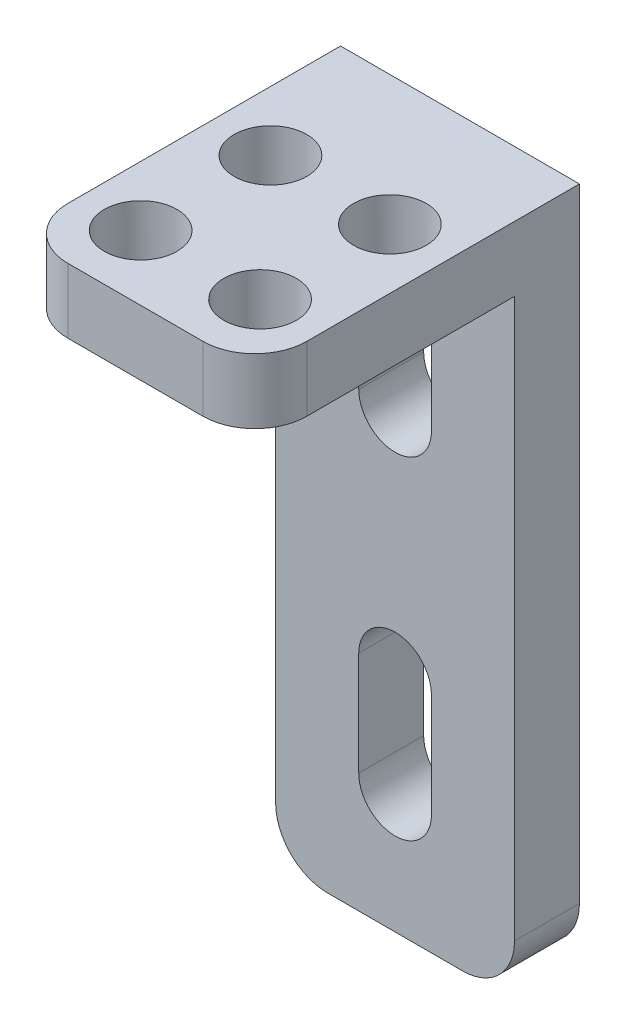
ISO-10303-21;
HEADER;
FILE_DESCRIPTION(('STEP AP214'),'2;1');
FILE_NAME('part.step','',(''),(''),'','','');
FILE_SCHEMA(('AUTOMOTIVE_DESIGN { 1 0 10303 214 1 1 1 1 }'));
ENDSEC;
DATA;
#1=APPLICATION_CONTEXT('core data for automotive mechanical design processes');
#2=APPLICATION_PROTOCOL_DEFINITION('international standard','automotive_design',2000,#1);
#3=PRODUCT_CONTEXT('',#1,'mechanical');
#4=PRODUCT('Part','Part','',(#3));
#5=PRODUCT_RELATED_PRODUCT_CATEGORY('part','',(#4));
#6=PRODUCT_DEFINITION_FORMATION('','',#4);
#7=PRODUCT_DEFINITION_CONTEXT('part definition',#1,'design');
#8=PRODUCT_DEFINITION('design','',#6,#7);
#9=PRODUCT_DEFINITION_SHAPE('','',#8);
#10=(LENGTH_UNIT() NAMED_UNIT(*) SI_UNIT(.MILLI.,.METRE.));
#11=(NAMED_UNIT(*) PLANE_ANGLE_UNIT() SI_UNIT($,.RADIAN.));
#12=(NAMED_UNIT(*) SI_UNIT($,.STERADIAN.) SOLID_ANGLE_UNIT());
#13=UNCERTAINTY_MEASURE_WITH_UNIT(LENGTH_MEASURE(1.E-05),#10,'distance_accuracy_value','');
#14=(GEOMETRIC_REPRESENTATION_CONTEXT(3) GLOBAL_UNCERTAINTY_ASSIGNED_CONTEXT((#13)) GLOBAL_UNIT_ASSIGNED_CONTEXT((#10,
#11,#12)) REPRESENTATION_CONTEXT('',''));
#15=CARTESIAN_POINT('',(0.,0.,0.));
#16=DIRECTION('',(0.,0.,1.));
#17=DIRECTION('',(1.,0.,0.));
#18=AXIS2_PLACEMENT_3D('',#15,#16,#17);
#19=CARTESIAN_POINT('',(0.,0.,3.175));
#20=DIRECTION('',(0.,0.,1.));
#21=DIRECTION('',(1.,0.,0.));
#22=AXIS2_PLACEMENT_3D('',#19,#20,#21);
#23=PLANE('',#22);
#24=DIRECTION('',(0.,-1.,0.));
#25=VECTOR('',#24,1.);
#26=CARTESIAN_POINT('',(-5.82032677750949,-16.51,3.175));
#27=LINE('',#26,#25);
#28=CARTESIAN_POINT('',(-5.82032677750949,13.335,3.175));
#29=VERTEX_POINT('',#28);
#30=CARTESIAN_POINT('',(-5.82032677750949,-13.97,3.175));
#31=VERTEX_POINT('',#30);
#32=EDGE_CURVE('E265',#29,#31,#27,.T.);
#33=ORIENTED_EDGE('',*,*,#32,.T.);
#34=CARTESIAN_POINT('',(-3.28032677750948,-13.97,3.175));
#35=DIRECTION('',(0.,0.,1.));
#36=DIRECTION('',(1.,0.,0.));
#37=AXIS2_PLACEMENT_3D('',#34,#35,#36);
#38=CIRCLE('',#37,2.54);
#39=CARTESIAN_POINT('',(-3.28032677750948,-16.51,3.175));
#40=VERTEX_POINT('',#39);
#41=EDGE_CURVE('E296',#31,#40,#38,.T.);
#42=ORIENTED_EDGE('',*,*,#41,.T.);
#43=DIRECTION('',(1.,0.,0.));
#44=VECTOR('',#43,1.);
#45=CARTESIAN_POINT('',(5.86367322249051,-16.51,3.175));
#46=LINE('',#45,#44);
#47=CARTESIAN_POINT('',(3.32367322249051,-16.51,3.175));
#48=VERTEX_POINT('',#47);
#49=EDGE_CURVE('E187',#40,#48,#46,.T.);
#50=ORIENTED_EDGE('',*,*,#49,.T.);
#51=CARTESIAN_POINT('',(3.32367322249051,-13.97,3.175));
#52=DIRECTION('',(0.,0.,1.));
#53=DIRECTION('',(1.,0.,0.));
#54=AXIS2_PLACEMENT_3D('',#51,#52,#53);
#55=CIRCLE('',#54,2.54);
#56=CARTESIAN_POINT('',(5.86367322249051,-13.97,3.175));
#57=VERTEX_POINT('',#56);
#58=EDGE_CURVE('E185',#48,#57,#55,.T.);
#59=ORIENTED_EDGE('',*,*,#58,.T.);
#60=DIRECTION('',(0.,1.,0.));
#61=VECTOR('',#60,1.);
#62=CARTESIAN_POINT('',(5.86367322249051,-16.51,3.175));
#63=LINE('',#62,#61);
#64=CARTESIAN_POINT('',(5.86367322249051,13.335,3.175));
#65=VERTEX_POINT('',#64);
#66=EDGE_CURVE('E167',#57,#65,#63,.T.);
#67=ORIENTED_EDGE('',*,*,#66,.T.);
#68=DIRECTION('',(1.,0.,0.));
#69=VECTOR('',#68,1.);
#70=CARTESIAN_POINT('',(-5.82032677750949,13.335,3.175));
#71=LINE('',#70,#69);
#72=EDGE_CURVE('E181',#29,#65,#71,.T.);
#73=ORIENTED_EDGE('',*,*,#72,.F.);
#74=EDGE_LOOP('',(#33,#42,#50,#59,#67,#73));
#75=FACE_BOUND('',#74,.T.);
#76=DIRECTION('',(0.,1.,0.));
#77=VECTOR('',#76,1.);
#78=CARTESIAN_POINT('',(1.79967322249051,5.588,3.175));
#79=LINE('',#78,#77);
#80=CARTESIAN_POINT('',(1.79967322249051,5.588,3.175));
#81=VERTEX_POINT('',#80);
#82=CARTESIAN_POINT('',(1.79967322249051,10.668,3.175));
#83=VERTEX_POINT('',#82);
#84=EDGE_CURVE('E236',#81,#83,#79,.T.);
#85=ORIENTED_EDGE('',*,*,#84,.F.);
#86=CARTESIAN_POINT('',(0.0216732224905147,5.588,3.175));
#87=DIRECTION('',(0.,0.,1.));
#88=DIRECTION('',(1.,0.,0.));
#89=AXIS2_PLACEMENT_3D('',#86,#87,#88);
#90=CIRCLE('',#89,1.778);
#91=CARTESIAN_POINT('',(-1.75632677750949,5.588,3.175));
#92=VERTEX_POINT('',#91);
#93=EDGE_CURVE('E234',#92,#81,#90,.T.);
#94=ORIENTED_EDGE('',*,*,#93,.F.);
#95=DIRECTION('',(0.,-1.,0.));
#96=VECTOR('',#95,1.);
#97=CARTESIAN_POINT('',(-1.75632677750949,5.588,3.175));
#98=LINE('',#97,#96);
#99=CARTESIAN_POINT('',(-1.75632677750949,10.668,3.175));
#100=VERTEX_POINT('',#99);
#101=EDGE_CURVE('E242',#100,#92,#98,.T.);
#102=ORIENTED_EDGE('',*,*,#101,.F.);
#103=CARTESIAN_POINT('',(0.0216732224905147,10.668,3.175));
#104=DIRECTION('',(0.,0.,1.));
#105=DIRECTION('',(1.,0.,0.));
#106=AXIS2_PLACEMENT_3D('',#103,#104,#105);
#107=CIRCLE('',#106,1.778);
#108=EDGE_CURVE('E239',#83,#100,#107,.T.);
#109=ORIENTED_EDGE('',*,*,#108,.F.);
#110=EDGE_LOOP('',(#85,#94,#102,#109));
#111=FACE_BOUND('',#110,.T.);
#112=DIRECTION('',(0.,-1.,0.));
#113=VECTOR('',#112,1.);
#114=CARTESIAN_POINT('',(-1.75632677750949,-5.588,3.175));
#115=LINE('',#114,#113);
#116=CARTESIAN_POINT('',(-1.75632677750949,-5.588,3.175));
#117=VERTEX_POINT('',#116);
#118=CARTESIAN_POINT('',(-1.75632677750949,-10.668,3.175));
#119=VERTEX_POINT('',#118);
#120=EDGE_CURVE('E205',#117,#119,#115,.T.);
#121=ORIENTED_EDGE('',*,*,#120,.F.);
#122=CARTESIAN_POINT('',(0.0216732224905147,-5.588,3.175));
#123=DIRECTION('',(0.,0.,1.));
#124=DIRECTION('',(-1.,0.,0.));
#125=AXIS2_PLACEMENT_3D('',#122,#123,#124);
#126=CIRCLE('',#125,1.778);
#127=CARTESIAN_POINT('',(1.79967322249051,-5.588,3.175));
#128=VERTEX_POINT('',#127);
#129=EDGE_CURVE('E203',#128,#117,#126,.T.);
#130=ORIENTED_EDGE('',*,*,#129,.F.);
#131=DIRECTION('',(0.,1.,0.));
#132=VECTOR('',#131,1.);
#133=CARTESIAN_POINT('',(1.79967322249051,-5.588,3.175));
#134=LINE('',#133,#132);
#135=CARTESIAN_POINT('',(1.79967322249051,-10.668,3.175));
#136=VERTEX_POINT('',#135);
#137=EDGE_CURVE('E211',#136,#128,#134,.T.);
#138=ORIENTED_EDGE('',*,*,#137,.F.);
#139=CARTESIAN_POINT('',(0.0216732224905147,-10.668,3.175));
#140=DIRECTION('',(0.,0.,1.));
#141=DIRECTION('',(-1.,0.,0.));
#142=AXIS2_PLACEMENT_3D('',#139,#140,#141);
#143=CIRCLE('',#142,1.778);
#144=EDGE_CURVE('E208',#119,#136,#143,.T.);
#145=ORIENTED_EDGE('',*,*,#144,.F.);
#146=EDGE_LOOP('',(#121,#130,#138,#145));
#147=FACE_BOUND('',#146,.T.);
#148=ADVANCED_FACE('F36',(#75,#111,#147),#23,.T.);
#149=CARTESIAN_POINT('',(0.,0.,0.));
#150=DIRECTION('',(0.,0.,1.));
#151=DIRECTION('',(1.,0.,0.));
#152=AXIS2_PLACEMENT_3D('',#149,#150,#151);
#153=PLANE('',#152);
#154=CARTESIAN_POINT('',(0.0216732224905147,5.588,0.));
#155=DIRECTION('',(0.,0.,1.));
#156=DIRECTION('',(1.,0.,0.));
#157=AXIS2_PLACEMENT_3D('',#154,#155,#156);
#158=CIRCLE('',#157,1.778);
#159=CARTESIAN_POINT('',(-1.75632677750949,5.588,0.));
#160=VERTEX_POINT('',#159);
#161=CARTESIAN_POINT('',(1.79967322249051,5.588,0.));
#162=VERTEX_POINT('',#161);
#163=EDGE_CURVE('E233',#160,#162,#158,.T.);
#164=ORIENTED_EDGE('',*,*,#163,.T.);
#165=DIRECTION('',(0.,1.,0.));
#166=VECTOR('',#165,1.);
#167=CARTESIAN_POINT('',(1.79967322249051,5.588,0.));
#168=LINE('',#167,#166);
#169=CARTESIAN_POINT('',(1.79967322249051,10.668,0.));
#170=VERTEX_POINT('',#169);
#171=EDGE_CURVE('E247',#162,#170,#168,.T.);
#172=ORIENTED_EDGE('',*,*,#171,.T.);
#173=CARTESIAN_POINT('',(0.0216732224905147,10.668,0.));
#174=DIRECTION('',(0.,0.,1.));
#175=DIRECTION('',(1.,0.,0.));
#176=AXIS2_PLACEMENT_3D('',#173,#174,#175);
#177=CIRCLE('',#176,1.778);
#178=CARTESIAN_POINT('',(-1.75632677750949,10.668,0.));
#179=VERTEX_POINT('',#178);
#180=EDGE_CURVE('E250',#170,#179,#177,.T.);
#181=ORIENTED_EDGE('',*,*,#180,.T.);
#182=DIRECTION('',(0.,-1.,0.));
#183=VECTOR('',#182,1.);
#184=CARTESIAN_POINT('',(-1.75632677750949,5.588,0.));
#185=LINE('',#184,#183);
#186=EDGE_CURVE('E237',#179,#160,#185,.T.);
#187=ORIENTED_EDGE('',*,*,#186,.T.);
#188=EDGE_LOOP('',(#164,#172,#181,#187));
#189=FACE_BOUND('',#188,.T.);
#190=DIRECTION('',(1.,0.,0.));
#191=VECTOR('',#190,1.);
#192=CARTESIAN_POINT('',(5.86367322249051,-16.51,0.));
#193=LINE('',#192,#191);
#194=CARTESIAN_POINT('',(-3.28032677750948,-16.51,0.));
#195=VERTEX_POINT('',#194);
#196=CARTESIAN_POINT('',(3.32367322249051,-16.51,0.));
#197=VERTEX_POINT('',#196);
#198=EDGE_CURVE('E271',#195,#197,#193,.T.);
#199=ORIENTED_EDGE('',*,*,#198,.F.);
#200=CARTESIAN_POINT('',(-3.28032677750948,-13.97,0.));
#201=DIRECTION('',(0.,0.,1.));
#202=DIRECTION('',(1.,0.,0.));
#203=AXIS2_PLACEMENT_3D('',#200,#201,#202);
#204=CIRCLE('',#203,2.54);
#205=CARTESIAN_POINT('',(-5.82032677750949,-13.97,0.));
#206=VERTEX_POINT('',#205);
#207=EDGE_CURVE('E289',#195,#206,#204,.F.);
#208=ORIENTED_EDGE('',*,*,#207,.T.);
#209=DIRECTION('',(0.,-1.,0.));
#210=VECTOR('',#209,1.);
#211=CARTESIAN_POINT('',(-5.82032677750949,-16.51,0.));
#212=LINE('',#211,#210);
#213=CARTESIAN_POINT('',(-5.82032677750949,16.51,0.));
#214=VERTEX_POINT('',#213);
#215=EDGE_CURVE('E264',#214,#206,#212,.T.);
#216=ORIENTED_EDGE('',*,*,#215,.F.);
#217=DIRECTION('',(-1.,0.,0.));
#218=VECTOR('',#217,1.);
#219=CARTESIAN_POINT('',(5.86367322249051,16.51,0.));
#220=LINE('',#219,#218);
#221=CARTESIAN_POINT('',(5.86367322249051,16.51,0.));
#222=VERTEX_POINT('',#221);
#223=EDGE_CURVE('E267',#222,#214,#220,.T.);
#224=ORIENTED_EDGE('',*,*,#223,.F.);
#225=DIRECTION('',(0.,1.,0.));
#226=VECTOR('',#225,1.);
#227=CARTESIAN_POINT('',(5.86367322249051,-16.51,0.));
#228=LINE('',#227,#226);
#229=CARTESIAN_POINT('',(5.86367322249051,-13.97,0.));
#230=VERTEX_POINT('',#229);
#231=EDGE_CURVE('E274',#230,#222,#228,.T.);
#232=ORIENTED_EDGE('',*,*,#231,.F.);
#233=CARTESIAN_POINT('',(3.32367322249051,-13.97,0.));
#234=DIRECTION('',(0.,0.,1.));
#235=DIRECTION('',(1.,0.,0.));
#236=AXIS2_PLACEMENT_3D('',#233,#234,#235);
#237=CIRCLE('',#236,2.54);
#238=EDGE_CURVE('E287',#230,#197,#237,.F.);
#239=ORIENTED_EDGE('',*,*,#238,.T.);
#240=EDGE_LOOP('',(#199,#208,#216,#224,#232,#239));
#241=FACE_BOUND('',#240,.T.);
#242=CARTESIAN_POINT('',(0.0216732224905147,-5.588,0.));
#243=DIRECTION('',(0.,0.,1.));
#244=DIRECTION('',(-1.,0.,0.));
#245=AXIS2_PLACEMENT_3D('',#242,#243,#244);
#246=CIRCLE('',#245,1.778);
#247=CARTESIAN_POINT('',(1.79967322249051,-5.588,0.));
#248=VERTEX_POINT('',#247);
#249=CARTESIAN_POINT('',(-1.75632677750949,-5.588,0.));
#250=VERTEX_POINT('',#249);
#251=EDGE_CURVE('E202',#248,#250,#246,.T.);
#252=ORIENTED_EDGE('',*,*,#251,.T.);
#253=DIRECTION('',(0.,-1.,0.));
#254=VECTOR('',#253,1.);
#255=CARTESIAN_POINT('',(-1.75632677750949,-5.588,0.));
#256=LINE('',#255,#254);
#257=CARTESIAN_POINT('',(-1.75632677750949,-10.668,0.));
#258=VERTEX_POINT('',#257);
#259=EDGE_CURVE('E216',#250,#258,#256,.T.);
#260=ORIENTED_EDGE('',*,*,#259,.T.);
#261=CARTESIAN_POINT('',(0.0216732224905147,-10.668,0.));
#262=DIRECTION('',(0.,0.,1.));
#263=DIRECTION('',(-1.,0.,0.));
#264=AXIS2_PLACEMENT_3D('',#261,#262,#263);
#265=CIRCLE('',#264,1.778);
#266=CARTESIAN_POINT('',(1.79967322249051,-10.668,0.));
#267=VERTEX_POINT('',#266);
#268=EDGE_CURVE('E219',#258,#267,#265,.T.);
#269=ORIENTED_EDGE('',*,*,#268,.T.);
#270=DIRECTION('',(0.,1.,0.));
#271=VECTOR('',#270,1.);
#272=CARTESIAN_POINT('',(1.79967322249051,-5.588,0.));
#273=LINE('',#272,#271);
#274=EDGE_CURVE('E206',#267,#248,#273,.T.);
#275=ORIENTED_EDGE('',*,*,#274,.T.);
#276=EDGE_LOOP('',(#252,#260,#269,#275));
#277=FACE_BOUND('',#276,.T.);
#278=ADVANCED_FACE('F329',(#189,#241,#277),#153,.F.);
#279=CARTESIAN_POINT('',(-5.82032677750949,-16.51,3.175));
#280=DIRECTION('',(1.,0.,0.));
#281=DIRECTION('',(0.,0.,-1.));
#282=AXIS2_PLACEMENT_3D('',#279,#280,#281);
#283=PLANE('',#282);
#284=ORIENTED_EDGE('',*,*,#215,.T.);
#285=DIRECTION('',(0.,0.,-1.));
#286=VECTOR('',#285,1.);
#287=CARTESIAN_POINT('',(-5.82032677750949,-13.97,3.175));
#288=LINE('',#287,#286);
#289=EDGE_CURVE('E293',#206,#31,#288,.F.);
#290=ORIENTED_EDGE('',*,*,#289,.T.);
#291=ORIENTED_EDGE('',*,*,#32,.F.);
#292=DIRECTION('',(0.,0.,-1.));
#293=VECTOR('',#292,1.);
#294=CARTESIAN_POINT('',(-5.82032677750949,13.335,15.875));
#295=LINE('',#294,#293);
#296=CARTESIAN_POINT('',(-5.82032677750949,13.335,13.335));
#297=VERTEX_POINT('',#296);
#298=EDGE_CURVE('E174',#297,#29,#295,.T.);
#299=ORIENTED_EDGE('',*,*,#298,.F.);
#300=DIRECTION('',(0.,-1.,0.));
#301=VECTOR('',#300,1.);
#302=CARTESIAN_POINT('',(-5.82032677750949,16.51,13.335));
#303=LINE('',#302,#301);
#304=CARTESIAN_POINT('',(-5.82032677750949,16.51,13.335));
#305=VERTEX_POINT('',#304);
#306=EDGE_CURVE('E291',#297,#305,#303,.F.);
#307=ORIENTED_EDGE('',*,*,#306,.T.);
#308=DIRECTION('',(0.,0.,-1.));
#309=VECTOR('',#308,1.);
#310=CARTESIAN_POINT('',(-5.82032677750949,16.51,3.175));
#311=LINE('',#310,#309);
#312=EDGE_CURVE('E186',#305,#214,#311,.T.);
#313=ORIENTED_EDGE('',*,*,#312,.T.);
#314=EDGE_LOOP('',(#284,#290,#291,#299,#307,#313));
#315=FACE_BOUND('',#314,.T.);
#316=ADVANCED_FACE('F312',(#315),#283,.F.);
#317=CARTESIAN_POINT('',(5.86367322249051,-16.51,3.175));
#318=DIRECTION('',(0.,1.,0.));
#319=DIRECTION('',(0.,0.,1.));
#320=AXIS2_PLACEMENT_3D('',#317,#318,#319);
#321=PLANE('',#320);
#322=ORIENTED_EDGE('',*,*,#49,.F.);
#323=DIRECTION('',(0.,0.,-1.));
#324=VECTOR('',#323,1.);
#325=CARTESIAN_POINT('',(-3.28032677750948,-16.51,3.175));
#326=LINE('',#325,#324);
#327=EDGE_CURVE('E284',#40,#195,#326,.T.);
#328=ORIENTED_EDGE('',*,*,#327,.T.);
#329=ORIENTED_EDGE('',*,*,#198,.T.);
#330=DIRECTION('',(0.,0.,-1.));
#331=VECTOR('',#330,1.);
#332=CARTESIAN_POINT('',(3.32367322249051,-16.51,3.175));
#333=LINE('',#332,#331);
#334=EDGE_CURVE('E282',#197,#48,#333,.F.);
#335=ORIENTED_EDGE('',*,*,#334,.T.);
#336=EDGE_LOOP('',(#322,#328,#329,#335));
#337=FACE_BOUND('',#336,.T.);
#338=ADVANCED_FACE('F345',(#337),#321,.F.);
#339=CARTESIAN_POINT('',(5.86367322249051,-16.51,3.175));
#340=DIRECTION('',(-1.,0.,0.));
#341=DIRECTION('',(0.,0.,1.));
#342=AXIS2_PLACEMENT_3D('',#339,#340,#341);
#343=PLANE('',#342);
#344=ORIENTED_EDGE('',*,*,#66,.F.);
#345=DIRECTION('',(0.,0.,-1.));
#346=VECTOR('',#345,1.);
#347=CARTESIAN_POINT('',(5.86367322249051,-13.97,3.175));
#348=LINE('',#347,#346);
#349=EDGE_CURVE('E299',#57,#230,#348,.T.);
#350=ORIENTED_EDGE('',*,*,#349,.T.);
#351=ORIENTED_EDGE('',*,*,#231,.T.);
#352=DIRECTION('',(0.,0.,-1.));
#353=VECTOR('',#352,1.);
#354=CARTESIAN_POINT('',(5.86367322249051,16.51,3.175));
#355=LINE('',#354,#353);
#356=CARTESIAN_POINT('',(5.86367322249051,16.51,13.335));
#357=VERTEX_POINT('',#356);
#358=EDGE_CURVE('E280',#357,#222,#355,.T.);
#359=ORIENTED_EDGE('',*,*,#358,.F.);
#360=DIRECTION('',(0.,1.,0.));
#361=VECTOR('',#360,1.);
#362=CARTESIAN_POINT('',(5.86367322249051,13.335,13.335));
#363=LINE('',#362,#361);
#364=CARTESIAN_POINT('',(5.86367322249051,13.335,13.335));
#365=VERTEX_POINT('',#364);
#366=EDGE_CURVE('E170',#357,#365,#363,.F.);
#367=ORIENTED_EDGE('',*,*,#366,.T.);
#368=DIRECTION('',(0.,0.,-1.));
#369=VECTOR('',#368,1.);
#370=CARTESIAN_POINT('',(5.86367322249051,13.335,15.875));
#371=LINE('',#370,#369);
#372=EDGE_CURVE('E163',#365,#65,#371,.T.);
#373=ORIENTED_EDGE('',*,*,#372,.T.);
#374=EDGE_LOOP('',(#344,#350,#351,#359,#367,#373));
#375=FACE_BOUND('',#374,.T.);
#376=ADVANCED_FACE('F165',(#375),#343,.F.);
#377=CARTESIAN_POINT('',(5.86367322249051,16.51,3.175));
#378=DIRECTION('',(0.,-1.,0.));
#379=DIRECTION('',(0.,0.,-1.));
#380=AXIS2_PLACEMENT_3D('',#377,#378,#379);
#381=PLANE('',#380);
#382=CARTESIAN_POINT('',(2.94267322249051,16.51,6.35));
#383=DIRECTION('',(0.,1.,0.));
#384=DIRECTION('',(0.,0.,-1.));
#385=AXIS2_PLACEMENT_3D('',#382,#383,#384);
#386=CIRCLE('',#385,1.778);
#387=CARTESIAN_POINT('',(2.94267322249051,16.51,4.572));
#388=VERTEX_POINT('',#387);
#389=EDGE_CURVE('E603',#388,#388,#386,.T.);
#390=ORIENTED_EDGE('',*,*,#389,.F.);
#391=EDGE_LOOP('',(#390));
#392=FACE_BOUND('',#391,.T.);
#393=CARTESIAN_POINT('',(-2.89932677750949,16.51,12.7));
#394=DIRECTION('',(0.,1.,0.));
#395=DIRECTION('',(0.,0.,-1.));
#396=AXIS2_PLACEMENT_3D('',#393,#394,#395);
#397=CIRCLE('',#396,1.778);
#398=CARTESIAN_POINT('',(-2.89932677750949,16.51,10.922));
#399=VERTEX_POINT('',#398);
#400=EDGE_CURVE('E595',#399,#399,#397,.T.);
#401=ORIENTED_EDGE('',*,*,#400,.F.);
#402=EDGE_LOOP('',(#401));
#403=FACE_BOUND('',#402,.T.);
#404=CARTESIAN_POINT('',(2.94267322249051,16.51,12.7));
#405=DIRECTION('',(0.,1.,0.));
#406=DIRECTION('',(0.,0.,1.));
#407=AXIS2_PLACEMENT_3D('',#404,#405,#406);
#408=CIRCLE('',#407,1.778);
#409=CARTESIAN_POINT('',(2.94267322249051,16.51,14.478));
#410=VERTEX_POINT('',#409);
#411=EDGE_CURVE('E596',#410,#410,#408,.T.);
#412=ORIENTED_EDGE('',*,*,#411,.F.);
#413=EDGE_LOOP('',(#412));
#414=FACE_BOUND('',#413,.T.);
#415=CARTESIAN_POINT('',(-2.89932677750949,16.51,6.35));
#416=DIRECTION('',(0.,1.,0.));
#417=DIRECTION('',(0.,0.,1.));
#418=AXIS2_PLACEMENT_3D('',#415,#416,#417);
#419=CIRCLE('',#418,1.778);
#420=CARTESIAN_POINT('',(-2.89932677750949,16.51,8.128));
#421=VERTEX_POINT('',#420);
#422=EDGE_CURVE('E197',#421,#421,#419,.T.);
#423=ORIENTED_EDGE('',*,*,#422,.F.);
#424=EDGE_LOOP('',(#423));
#425=FACE_BOUND('',#424,.T.);
#426=DIRECTION('',(-1.,0.,0.));
#427=VECTOR('',#426,1.);
#428=CARTESIAN_POINT('',(-5.82032677750949,16.51,15.875));
#429=LINE('',#428,#427);
#430=CARTESIAN_POINT('',(3.32367322249051,16.51,15.875));
#431=VERTEX_POINT('',#430);
#432=CARTESIAN_POINT('',(-3.28032677750949,16.51,15.875));
#433=VERTEX_POINT('',#432);
#434=EDGE_CURVE('E175',#431,#433,#429,.T.);
#435=ORIENTED_EDGE('',*,*,#434,.F.);
#436=CARTESIAN_POINT('',(3.32367322249051,16.51,13.335));
#437=DIRECTION('',(0.,-1.,0.));
#438=DIRECTION('',(0.,0.,-1.));
#439=AXIS2_PLACEMENT_3D('',#436,#437,#438);
#440=CIRCLE('',#439,2.54);
#441=EDGE_CURVE('E59',#431,#357,#440,.F.);
#442=ORIENTED_EDGE('',*,*,#441,.T.);
#443=ORIENTED_EDGE('',*,*,#358,.T.);
#444=ORIENTED_EDGE('',*,*,#223,.T.);
#445=ORIENTED_EDGE('',*,*,#312,.F.);
#446=CARTESIAN_POINT('',(-3.28032677750949,16.51,13.335));
#447=DIRECTION('',(0.,-1.,0.));
#448=DIRECTION('',(0.,0.,-1.));
#449=AXIS2_PLACEMENT_3D('',#446,#447,#448);
#450=CIRCLE('',#449,2.54);
#451=EDGE_CURVE('E51',#305,#433,#450,.F.);
#452=ORIENTED_EDGE('',*,*,#451,.T.);
#453=EDGE_LOOP('',(#435,#442,#443,#444,#445,#452));
#454=FACE_BOUND('',#453,.T.);
#455=ADVANCED_FACE('F315',(#392,#403,#414,#425,#454),#381,.F.);
#456=CARTESIAN_POINT('',(0.0216732224905147,5.588,3.175));
#457=DIRECTION('',(0.,0.,-1.));
#458=DIRECTION('',(-1.,0.,0.));
#459=AXIS2_PLACEMENT_3D('',#456,#457,#458);
#460=CYLINDRICAL_SURFACE('',#459,1.778);
#461=ORIENTED_EDGE('',*,*,#163,.F.);
#462=DIRECTION('',(0.,0.,-1.));
#463=VECTOR('',#462,1.);
#464=CARTESIAN_POINT('',(-1.75632677750949,5.588,3.175));
#465=LINE('',#464,#463);
#466=EDGE_CURVE('E244',#92,#160,#465,.T.);
#467=ORIENTED_EDGE('',*,*,#466,.F.);
#468=ORIENTED_EDGE('',*,*,#93,.T.);
#469=DIRECTION('',(0.,0.,-1.));
#470=VECTOR('',#469,1.);
#471=CARTESIAN_POINT('',(1.79967322249051,5.588,3.175));
#472=LINE('',#471,#470);
#473=EDGE_CURVE('E261',#81,#162,#472,.T.);
#474=ORIENTED_EDGE('',*,*,#473,.T.);
#475=EDGE_LOOP('',(#461,#467,#468,#474));
#476=FACE_BOUND('',#475,.T.);
#477=ADVANCED_FACE('F337',(#476),#460,.F.);
#478=CARTESIAN_POINT('',(1.79967322249051,5.588,3.175));
#479=DIRECTION('',(-1.,0.,0.));
#480=DIRECTION('',(0.,0.,1.));
#481=AXIS2_PLACEMENT_3D('',#478,#479,#480);
#482=PLANE('',#481);
#483=ORIENTED_EDGE('',*,*,#171,.F.);
#484=ORIENTED_EDGE('',*,*,#473,.F.);
#485=ORIENTED_EDGE('',*,*,#84,.T.);
#486=DIRECTION('',(0.,0.,-1.));
#487=VECTOR('',#486,1.);
#488=CARTESIAN_POINT('',(1.79967322249051,10.668,3.175));
#489=LINE('',#488,#487);
#490=EDGE_CURVE('E259',#83,#170,#489,.T.);
#491=ORIENTED_EDGE('',*,*,#490,.T.);
#492=EDGE_LOOP('',(#483,#484,#485,#491));
#493=FACE_BOUND('',#492,.T.);
#494=ADVANCED_FACE('F405',(#493),#482,.T.);
#495=CARTESIAN_POINT('',(0.0216732224905147,10.668,3.175));
#496=DIRECTION('',(0.,0.,-1.));
#497=DIRECTION('',(-1.,0.,0.));
#498=AXIS2_PLACEMENT_3D('',#495,#496,#497);
#499=CYLINDRICAL_SURFACE('',#498,1.778);
#500=ORIENTED_EDGE('',*,*,#180,.F.);
#501=ORIENTED_EDGE('',*,*,#490,.F.);
#502=ORIENTED_EDGE('',*,*,#108,.T.);
#503=DIRECTION('',(0.,0.,-1.));
#504=VECTOR('',#503,1.);
#505=CARTESIAN_POINT('',(-1.75632677750949,10.668,3.175));
#506=LINE('',#505,#504);
#507=EDGE_CURVE('E257',#100,#179,#506,.T.);
#508=ORIENTED_EDGE('',*,*,#507,.T.);
#509=EDGE_LOOP('',(#500,#501,#502,#508));
#510=FACE_BOUND('',#509,.T.);
#511=ADVANCED_FACE('F402',(#510),#499,.F.);
#512=CARTESIAN_POINT('',(-1.75632677750949,5.588,3.175));
#513=DIRECTION('',(1.,0.,0.));
#514=DIRECTION('',(0.,0.,-1.));
#515=AXIS2_PLACEMENT_3D('',#512,#513,#514);
#516=PLANE('',#515);
#517=ORIENTED_EDGE('',*,*,#186,.F.);
#518=ORIENTED_EDGE('',*,*,#507,.F.);
#519=ORIENTED_EDGE('',*,*,#101,.T.);
#520=ORIENTED_EDGE('',*,*,#466,.T.);
#521=EDGE_LOOP('',(#517,#518,#519,#520));
#522=FACE_BOUND('',#521,.T.);
#523=ADVANCED_FACE('F399',(#522),#516,.T.);
#524=CARTESIAN_POINT('',(0.0216732224905147,-5.588,3.175));
#525=DIRECTION('',(0.,0.,-1.));
#526=DIRECTION('',(-1.,0.,0.));
#527=AXIS2_PLACEMENT_3D('',#524,#525,#526);
#528=CYLINDRICAL_SURFACE('',#527,1.778);
#529=ORIENTED_EDGE('',*,*,#251,.F.);
#530=DIRECTION('',(0.,0.,-1.));
#531=VECTOR('',#530,1.);
#532=CARTESIAN_POINT('',(1.79967322249051,-5.588,3.175));
#533=LINE('',#532,#531);
#534=EDGE_CURVE('E213',#128,#248,#533,.T.);
#535=ORIENTED_EDGE('',*,*,#534,.F.);
#536=ORIENTED_EDGE('',*,*,#129,.T.);
#537=DIRECTION('',(0.,0.,-1.));
#538=VECTOR('',#537,1.);
#539=CARTESIAN_POINT('',(-1.75632677750949,-5.588,3.175));
#540=LINE('',#539,#538);
#541=EDGE_CURVE('E230',#117,#250,#540,.T.);
#542=ORIENTED_EDGE('',*,*,#541,.T.);
#543=EDGE_LOOP('',(#529,#535,#536,#542));
#544=FACE_BOUND('',#543,.T.);
#545=ADVANCED_FACE('F372',(#544),#528,.F.);
#546=CARTESIAN_POINT('',(-1.75632677750949,-5.588,3.175));
#547=DIRECTION('',(1.,0.,0.));
#548=DIRECTION('',(0.,0.,-1.));
#549=AXIS2_PLACEMENT_3D('',#546,#547,#548);
#550=PLANE('',#549);
#551=ORIENTED_EDGE('',*,*,#259,.F.);
#552=ORIENTED_EDGE('',*,*,#541,.F.);
#553=ORIENTED_EDGE('',*,*,#120,.T.);
#554=DIRECTION('',(0.,0.,-1.));
#555=VECTOR('',#554,1.);
#556=CARTESIAN_POINT('',(-1.75632677750949,-10.668,3.175));
#557=LINE('',#556,#555);
#558=EDGE_CURVE('E228',#119,#258,#557,.T.);
#559=ORIENTED_EDGE('',*,*,#558,.T.);
#560=EDGE_LOOP('',(#551,#552,#553,#559));
#561=FACE_BOUND('',#560,.T.);
#562=ADVANCED_FACE('F382',(#561),#550,.T.);
#563=CARTESIAN_POINT('',(0.0216732224905147,-10.668,3.175));
#564=DIRECTION('',(0.,0.,-1.));
#565=DIRECTION('',(-1.,0.,0.));
#566=AXIS2_PLACEMENT_3D('',#563,#564,#565);
#567=CYLINDRICAL_SURFACE('',#566,1.778);
#568=ORIENTED_EDGE('',*,*,#268,.F.);
#569=ORIENTED_EDGE('',*,*,#558,.F.);
#570=ORIENTED_EDGE('',*,*,#144,.T.);
#571=DIRECTION('',(0.,0.,-1.));
#572=VECTOR('',#571,1.);
#573=CARTESIAN_POINT('',(1.79967322249051,-10.668,3.175));
#574=LINE('',#573,#572);
#575=EDGE_CURVE('E226',#136,#267,#574,.T.);
#576=ORIENTED_EDGE('',*,*,#575,.T.);
#577=EDGE_LOOP('',(#568,#569,#570,#576));
#578=FACE_BOUND('',#577,.T.);
#579=ADVANCED_FACE('F386',(#578),#567,.F.);
#580=CARTESIAN_POINT('',(1.79967322249051,-5.588,3.175));
#581=DIRECTION('',(-1.,0.,0.));
#582=DIRECTION('',(0.,0.,1.));
#583=AXIS2_PLACEMENT_3D('',#580,#581,#582);
#584=PLANE('',#583);
#585=ORIENTED_EDGE('',*,*,#274,.F.);
#586=ORIENTED_EDGE('',*,*,#575,.F.);
#587=ORIENTED_EDGE('',*,*,#137,.T.);
#588=ORIENTED_EDGE('',*,*,#534,.T.);
#589=EDGE_LOOP('',(#585,#586,#587,#588));
#590=FACE_BOUND('',#589,.T.);
#591=ADVANCED_FACE('F376',(#590),#584,.T.);
#592=CARTESIAN_POINT('',(-5.82032677750949,13.335,15.875));
#593=DIRECTION('',(0.,1.,0.));
#594=DIRECTION('',(0.,0.,1.));
#595=AXIS2_PLACEMENT_3D('',#592,#593,#594);
#596=PLANE('',#595);
#597=CARTESIAN_POINT('',(2.94267322249051,13.335,6.35));
#598=DIRECTION('',(0.,1.,0.));
#599=DIRECTION('',(0.,0.,1.));
#600=AXIS2_PLACEMENT_3D('',#597,#598,#599);
#601=CIRCLE('',#600,1.778);
#602=CARTESIAN_POINT('',(2.94267322249051,13.335,8.128));
#603=VERTEX_POINT('',#602);
#604=EDGE_CURVE('E583',#603,#603,#601,.F.);
#605=ORIENTED_EDGE('',*,*,#604,.F.);
#606=EDGE_LOOP('',(#605));
#607=FACE_BOUND('',#606,.T.);
#608=CARTESIAN_POINT('',(-2.89932677750949,13.335,12.7));
#609=DIRECTION('',(0.,1.,0.));
#610=DIRECTION('',(0.,0.,1.));
#611=AXIS2_PLACEMENT_3D('',#608,#609,#610);
#612=CIRCLE('',#611,1.778);
#613=CARTESIAN_POINT('',(-2.89932677750949,13.335,14.478));
#614=VERTEX_POINT('',#613);
#615=EDGE_CURVE('E587',#614,#614,#612,.F.);
#616=ORIENTED_EDGE('',*,*,#615,.F.);
#617=EDGE_LOOP('',(#616));
#618=FACE_BOUND('',#617,.T.);
#619=CARTESIAN_POINT('',(2.94267322249051,13.335,12.7));
#620=DIRECTION('',(0.,1.,0.));
#621=DIRECTION('',(0.,0.,1.));
#622=AXIS2_PLACEMENT_3D('',#619,#620,#621);
#623=CIRCLE('',#622,1.778);
#624=CARTESIAN_POINT('',(2.94267322249051,13.335,14.478));
#625=VERTEX_POINT('',#624);
#626=EDGE_CURVE('E591',#625,#625,#623,.F.);
#627=ORIENTED_EDGE('',*,*,#626,.F.);
#628=EDGE_LOOP('',(#627));
#629=FACE_BOUND('',#628,.T.);
#630=CARTESIAN_POINT('',(-2.89932677750949,13.335,6.35));
#631=DIRECTION('',(0.,1.,0.));
#632=DIRECTION('',(0.,0.,1.));
#633=AXIS2_PLACEMENT_3D('',#630,#631,#632);
#634=CIRCLE('',#633,1.778);
#635=CARTESIAN_POINT('',(-2.89932677750949,13.335,8.128));
#636=VERTEX_POINT('',#635);
#637=EDGE_CURVE('E192',#636,#636,#634,.F.);
#638=ORIENTED_EDGE('',*,*,#637,.F.);
#639=EDGE_LOOP('',(#638));
#640=FACE_BOUND('',#639,.T.);
#641=ORIENTED_EDGE('',*,*,#372,.F.);
#642=CARTESIAN_POINT('',(3.32367322249051,13.335,13.335));
#643=DIRECTION('',(0.,1.,0.));
#644=DIRECTION('',(0.,0.,1.));
#645=AXIS2_PLACEMENT_3D('',#642,#643,#644);
#646=CIRCLE('',#645,2.54);
#647=CARTESIAN_POINT('',(3.32367322249051,13.335,15.875));
#648=VERTEX_POINT('',#647);
#649=EDGE_CURVE('E11',#365,#648,#646,.F.);
#650=ORIENTED_EDGE('',*,*,#649,.T.);
#651=DIRECTION('',(1.,0.,0.));
#652=VECTOR('',#651,1.);
#653=CARTESIAN_POINT('',(-5.82032677750949,13.335,15.875));
#654=LINE('',#653,#652);
#655=CARTESIAN_POINT('',(-3.28032677750949,13.335,15.875));
#656=VERTEX_POINT('',#655);
#657=EDGE_CURVE('E191',#656,#648,#654,.T.);
#658=ORIENTED_EDGE('',*,*,#657,.F.);
#659=CARTESIAN_POINT('',(-3.28032677750949,13.335,13.335));
#660=DIRECTION('',(0.,1.,0.));
#661=DIRECTION('',(0.,0.,1.));
#662=AXIS2_PLACEMENT_3D('',#659,#660,#661);
#663=CIRCLE('',#662,2.54);
#664=EDGE_CURVE('E44',#656,#297,#663,.F.);
#665=ORIENTED_EDGE('',*,*,#664,.T.);
#666=ORIENTED_EDGE('',*,*,#298,.T.);
#667=ORIENTED_EDGE('',*,*,#72,.T.);
#668=EDGE_LOOP('',(#641,#650,#658,#665,#666,#667));
#669=FACE_BOUND('',#668,.T.);
#670=ADVANCED_FACE('F189',(#607,#618,#629,#640,#669),#596,.F.);
#671=CARTESIAN_POINT('',(0.,0.,15.875));
#672=DIRECTION('',(0.,0.,1.));
#673=DIRECTION('',(1.,0.,0.));
#674=AXIS2_PLACEMENT_3D('',#671,#672,#673);
#675=PLANE('',#674);
#676=ORIENTED_EDGE('',*,*,#657,.T.);
#677=DIRECTION('',(0.,1.,0.));
#678=VECTOR('',#677,1.);
#679=CARTESIAN_POINT('',(3.32367322249051,16.51,15.875));
#680=LINE('',#679,#678);
#681=EDGE_CURVE('E304',#648,#431,#680,.T.);
#682=ORIENTED_EDGE('',*,*,#681,.T.);
#683=ORIENTED_EDGE('',*,*,#434,.T.);
#684=DIRECTION('',(0.,-1.,0.));
#685=VECTOR('',#684,1.);
#686=CARTESIAN_POINT('',(-3.28032677750949,13.335,15.875));
#687=LINE('',#686,#685);
#688=EDGE_CURVE('E301',#433,#656,#687,.T.);
#689=ORIENTED_EDGE('',*,*,#688,.T.);
#690=EDGE_LOOP('',(#676,#682,#683,#689));
#691=FACE_BOUND('',#690,.T.);
#692=ADVANCED_FACE('F314',(#691),#675,.T.);
#693=CARTESIAN_POINT('',(-2.89932677750949,-16.511,6.35));
#694=DIRECTION('',(0.,1.,0.));
#695=DIRECTION('',(0.,0.,1.));
#696=AXIS2_PLACEMENT_3D('',#693,#694,#695);
#697=CYLINDRICAL_SURFACE('',#696,1.778);
#698=ORIENTED_EDGE('',*,*,#422,.T.);
#699=EDGE_LOOP('',(#698));
#700=FACE_BOUND('',#699,.T.);
#701=ORIENTED_EDGE('',*,*,#637,.T.);
#702=EDGE_LOOP('',(#701));
#703=FACE_BOUND('',#702,.T.);
#704=ADVANCED_FACE('F476',(#700,#703),#697,.F.);
#705=CARTESIAN_POINT('',(2.94267322249051,-16.511,12.7));
#706=DIRECTION('',(0.,1.,0.));
#707=DIRECTION('',(0.,0.,1.));
#708=AXIS2_PLACEMENT_3D('',#705,#706,#707);
#709=CYLINDRICAL_SURFACE('',#708,1.778);
#710=ORIENTED_EDGE('',*,*,#411,.T.);
#711=EDGE_LOOP('',(#710));
#712=FACE_BOUND('',#711,.T.);
#713=ORIENTED_EDGE('',*,*,#626,.T.);
#714=EDGE_LOOP('',(#713));
#715=FACE_BOUND('',#714,.T.);
#716=ADVANCED_FACE('F466',(#712,#715),#709,.F.);
#717=CARTESIAN_POINT('',(-2.89932677750949,-16.511,12.7));
#718=DIRECTION('',(0.,1.,0.));
#719=DIRECTION('',(0.,0.,1.));
#720=AXIS2_PLACEMENT_3D('',#717,#718,#719);
#721=CYLINDRICAL_SURFACE('',#720,1.778);
#722=ORIENTED_EDGE('',*,*,#400,.T.);
#723=EDGE_LOOP('',(#722));
#724=FACE_BOUND('',#723,.T.);
#725=ORIENTED_EDGE('',*,*,#615,.T.);
#726=EDGE_LOOP('',(#725));
#727=FACE_BOUND('',#726,.T.);
#728=ADVANCED_FACE('F357',(#724,#727),#721,.F.);
#729=CARTESIAN_POINT('',(2.94267322249051,-16.511,6.35));
#730=DIRECTION('',(0.,1.,0.));
#731=DIRECTION('',(0.,0.,1.));
#732=AXIS2_PLACEMENT_3D('',#729,#730,#731);
#733=CYLINDRICAL_SURFACE('',#732,1.778);
#734=ORIENTED_EDGE('',*,*,#389,.T.);
#735=EDGE_LOOP('',(#734));
#736=FACE_BOUND('',#735,.T.);
#737=ORIENTED_EDGE('',*,*,#604,.T.);
#738=EDGE_LOOP('',(#737));
#739=FACE_BOUND('',#738,.T.);
#740=ADVANCED_FACE('F352',(#736,#739),#733,.F.);
#741=CARTESIAN_POINT('',(-3.28032677750948,-13.97,3.175));
#742=DIRECTION('',(0.,0.,-1.));
#743=DIRECTION('',(-1.,0.,0.));
#744=AXIS2_PLACEMENT_3D('',#741,#742,#743);
#745=CYLINDRICAL_SURFACE('',#744,2.54);
#746=ORIENTED_EDGE('',*,*,#41,.F.);
#747=ORIENTED_EDGE('',*,*,#289,.F.);
#748=ORIENTED_EDGE('',*,*,#207,.F.);
#749=ORIENTED_EDGE('',*,*,#327,.F.);
#750=EDGE_LOOP('',(#746,#747,#748,#749));
#751=FACE_BOUND('',#750,.T.);
#752=ADVANCED_FACE('F325',(#751),#745,.T.);
#753=CARTESIAN_POINT('',(3.32367322249051,-13.97,3.175));
#754=DIRECTION('',(0.,0.,-1.));
#755=DIRECTION('',(-1.,0.,0.));
#756=AXIS2_PLACEMENT_3D('',#753,#754,#755);
#757=CYLINDRICAL_SURFACE('',#756,2.54);
#758=ORIENTED_EDGE('',*,*,#58,.F.);
#759=ORIENTED_EDGE('',*,*,#334,.F.);
#760=ORIENTED_EDGE('',*,*,#238,.F.);
#761=ORIENTED_EDGE('',*,*,#349,.F.);
#762=EDGE_LOOP('',(#758,#759,#760,#761));
#763=FACE_BOUND('',#762,.T.);
#764=ADVANCED_FACE('F320',(#763),#757,.T.);
#765=CARTESIAN_POINT('',(3.32367322249051,0.,13.335));
#766=DIRECTION('',(0.,-1.,0.));
#767=DIRECTION('',(0.,0.,-1.));
#768=AXIS2_PLACEMENT_3D('',#765,#766,#767);
#769=CYLINDRICAL_SURFACE('',#768,2.54);
#770=ORIENTED_EDGE('',*,*,#649,.F.);
#771=ORIENTED_EDGE('',*,*,#366,.F.);
#772=ORIENTED_EDGE('',*,*,#441,.F.);
#773=ORIENTED_EDGE('',*,*,#681,.F.);
#774=EDGE_LOOP('',(#770,#771,#772,#773));
#775=FACE_BOUND('',#774,.T.);
#776=ADVANCED_FACE('F318',(#775),#769,.T.);
#777=CARTESIAN_POINT('',(-3.28032677750949,0.,13.335));
#778=DIRECTION('',(0.,1.,0.));
#779=DIRECTION('',(0.,0.,1.));
#780=AXIS2_PLACEMENT_3D('',#777,#778,#779);
#781=CYLINDRICAL_SURFACE('',#780,2.54);
#782=ORIENTED_EDGE('',*,*,#451,.F.);
#783=ORIENTED_EDGE('',*,*,#306,.F.);
#784=ORIENTED_EDGE('',*,*,#664,.F.);
#785=ORIENTED_EDGE('',*,*,#688,.F.);
#786=EDGE_LOOP('',(#782,#783,#784,#785));
#787=FACE_BOUND('',#786,.T.);
#788=ADVANCED_FACE('F38',(#787),#781,.T.);
#789=CLOSED_SHELL('',(#148,#278,#316,#338,#376,#455,#477,#494,#511,#523,#545,#562,#579,#591,
#670,#692,#704,#716,#728,#740,#752,#764,#776,#788));
#790=MANIFOLD_SOLID_BREP('B2',#789);
#791=ADVANCED_BREP_SHAPE_REPRESENTATION('',(#18,#790),#14);
#792=SHAPE_DEFINITION_REPRESENTATION(#9,#791);
ENDSEC;
END-ISO-10303-21;
